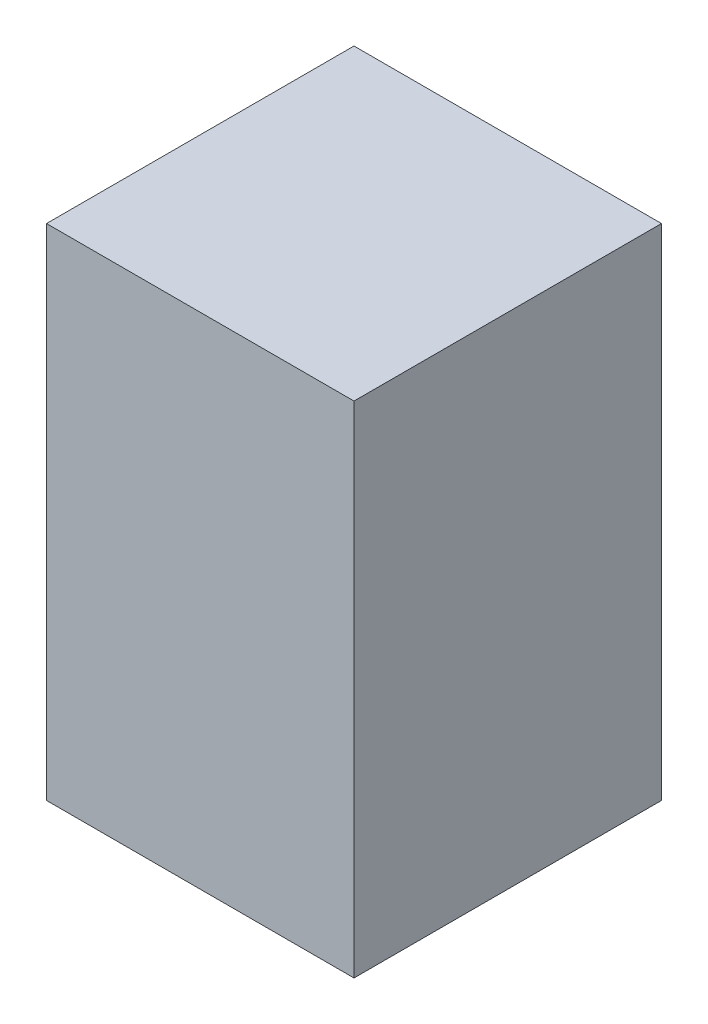
ISO-10303-21;
HEADER;
FILE_DESCRIPTION(('STEP AP214'),'2;1');
FILE_NAME('part.step','',(''),(''),'','','');
FILE_SCHEMA(('AUTOMOTIVE_DESIGN { 1 0 10303 214 1 1 1 1 }'));
ENDSEC;
DATA;
#1=APPLICATION_CONTEXT('core data for automotive mechanical design processes');
#2=APPLICATION_PROTOCOL_DEFINITION('international standard','automotive_design',2000,#1);
#3=PRODUCT_CONTEXT('',#1,'mechanical');
#4=PRODUCT('Part','Part','',(#3));
#5=PRODUCT_RELATED_PRODUCT_CATEGORY('part','',(#4));
#6=PRODUCT_DEFINITION_FORMATION('','',#4);
#7=PRODUCT_DEFINITION_CONTEXT('part definition',#1,'design');
#8=PRODUCT_DEFINITION('design','',#6,#7);
#9=PRODUCT_DEFINITION_SHAPE('','',#8);
#10=(LENGTH_UNIT() NAMED_UNIT(*) SI_UNIT(.MILLI.,.METRE.));
#11=(NAMED_UNIT(*) PLANE_ANGLE_UNIT() SI_UNIT($,.RADIAN.));
#12=(NAMED_UNIT(*) SI_UNIT($,.STERADIAN.) SOLID_ANGLE_UNIT());
#13=UNCERTAINTY_MEASURE_WITH_UNIT(LENGTH_MEASURE(1.E-05),#10,'distance_accuracy_value','');
#14=(GEOMETRIC_REPRESENTATION_CONTEXT(3) GLOBAL_UNCERTAINTY_ASSIGNED_CONTEXT((#13)) GLOBAL_UNIT_ASSIGNED_CONTEXT((#10,
#11,#12)) REPRESENTATION_CONTEXT('',''));
#15=CARTESIAN_POINT('',(0.,0.,0.));
#16=DIRECTION('',(0.,0.,1.));
#17=DIRECTION('',(1.,0.,0.));
#18=AXIS2_PLACEMENT_3D('',#15,#16,#17);
#19=CARTESIAN_POINT('',(10.,32.5,10.));
#20=DIRECTION('',(-1.,0.,0.));
#21=DIRECTION('',(0.,0.,1.));
#22=AXIS2_PLACEMENT_3D('',#19,#20,#21);
#23=PLANE('',#22);
#24=DIRECTION('',(0.,0.,-1.));
#25=VECTOR('',#24,1.);
#26=CARTESIAN_POINT('',(10.,0.,10.));
#27=LINE('',#26,#25);
#28=CARTESIAN_POINT('',(10.,0.,10.));
#29=VERTEX_POINT('',#28);
#30=CARTESIAN_POINT('',(10.,0.,-10.));
#31=VERTEX_POINT('',#30);
#32=EDGE_CURVE('E95',#29,#31,#27,.T.);
#33=ORIENTED_EDGE('',*,*,#32,.T.);
#34=DIRECTION('',(0.,-1.,0.));
#35=VECTOR('',#34,1.);
#36=CARTESIAN_POINT('',(10.,32.5,-10.));
#37=LINE('',#36,#35);
#38=CARTESIAN_POINT('',(10.,32.5,-10.));
#39=VERTEX_POINT('',#38);
#40=EDGE_CURVE('E11',#39,#31,#37,.T.);
#41=ORIENTED_EDGE('',*,*,#40,.F.);
#42=DIRECTION('',(0.,0.,-1.));
#43=VECTOR('',#42,1.);
#44=CARTESIAN_POINT('',(10.,32.5,10.));
#45=LINE('',#44,#43);
#46=CARTESIAN_POINT('',(10.,32.5,10.));
#47=VERTEX_POINT('',#46);
#48=EDGE_CURVE('E83',#47,#39,#45,.T.);
#49=ORIENTED_EDGE('',*,*,#48,.F.);
#50=DIRECTION('',(0.,-1.,0.));
#51=VECTOR('',#50,1.);
#52=CARTESIAN_POINT('',(10.,32.5,10.));
#53=LINE('',#52,#51);
#54=EDGE_CURVE('E91',#47,#29,#53,.T.);
#55=ORIENTED_EDGE('',*,*,#54,.T.);
#56=EDGE_LOOP('',(#33,#41,#49,#55));
#57=FACE_BOUND('',#56,.T.);
#58=ADVANCED_FACE('F32',(#57),#23,.F.);
#59=CARTESIAN_POINT('',(-10.,32.5,-10.));
#60=DIRECTION('',(0.,0.,1.));
#61=DIRECTION('',(1.,0.,0.));
#62=AXIS2_PLACEMENT_3D('',#59,#60,#61);
#63=PLANE('',#62);
#64=DIRECTION('',(-1.,0.,0.));
#65=VECTOR('',#64,1.);
#66=CARTESIAN_POINT('',(-10.,0.,-10.));
#67=LINE('',#66,#65);
#68=CARTESIAN_POINT('',(-10.,0.,-10.));
#69=VERTEX_POINT('',#68);
#70=EDGE_CURVE('E87',#31,#69,#67,.T.);
#71=ORIENTED_EDGE('',*,*,#70,.T.);
#72=DIRECTION('',(0.,-1.,0.));
#73=VECTOR('',#72,1.);
#74=CARTESIAN_POINT('',(-10.,32.5,-10.));
#75=LINE('',#74,#73);
#76=CARTESIAN_POINT('',(-10.,32.5,-10.));
#77=VERTEX_POINT('',#76);
#78=EDGE_CURVE('E40',#77,#69,#75,.T.);
#79=ORIENTED_EDGE('',*,*,#78,.F.);
#80=DIRECTION('',(-1.,0.,0.));
#81=VECTOR('',#80,1.);
#82=CARTESIAN_POINT('',(-10.,32.5,-10.));
#83=LINE('',#82,#81);
#84=EDGE_CURVE('E78',#39,#77,#83,.T.);
#85=ORIENTED_EDGE('',*,*,#84,.F.);
#86=ORIENTED_EDGE('',*,*,#40,.T.);
#87=EDGE_LOOP('',(#71,#79,#85,#86));
#88=FACE_BOUND('',#87,.T.);
#89=ADVANCED_FACE('F86',(#88),#63,.F.);
#90=CARTESIAN_POINT('',(-10.,32.5,10.));
#91=DIRECTION('',(1.,0.,0.));
#92=DIRECTION('',(0.,0.,-1.));
#93=AXIS2_PLACEMENT_3D('',#90,#91,#92);
#94=PLANE('',#93);
#95=DIRECTION('',(0.,0.,1.));
#96=VECTOR('',#95,1.);
#97=CARTESIAN_POINT('',(-10.,0.,10.));
#98=LINE('',#97,#96);
#99=CARTESIAN_POINT('',(-10.,0.,10.));
#100=VERTEX_POINT('',#99);
#101=EDGE_CURVE('E65',#69,#100,#98,.T.);
#102=ORIENTED_EDGE('',*,*,#101,.T.);
#103=DIRECTION('',(0.,-1.,0.));
#104=VECTOR('',#103,1.);
#105=CARTESIAN_POINT('',(-10.,32.5,10.));
#106=LINE('',#105,#104);
#107=CARTESIAN_POINT('',(-10.,32.5,10.));
#108=VERTEX_POINT('',#107);
#109=EDGE_CURVE('E88',#108,#100,#106,.T.);
#110=ORIENTED_EDGE('',*,*,#109,.F.);
#111=DIRECTION('',(0.,0.,1.));
#112=VECTOR('',#111,1.);
#113=CARTESIAN_POINT('',(-10.,32.5,10.));
#114=LINE('',#113,#112);
#115=EDGE_CURVE('E81',#77,#108,#114,.T.);
#116=ORIENTED_EDGE('',*,*,#115,.F.);
#117=ORIENTED_EDGE('',*,*,#78,.T.);
#118=EDGE_LOOP('',(#102,#110,#116,#117));
#119=FACE_BOUND('',#118,.T.);
#120=ADVANCED_FACE('F89',(#119),#94,.F.);
#121=CARTESIAN_POINT('',(-10.,32.5,10.));
#122=DIRECTION('',(0.,0.,-1.));
#123=DIRECTION('',(-1.,0.,0.));
#124=AXIS2_PLACEMENT_3D('',#121,#122,#123);
#125=PLANE('',#124);
#126=DIRECTION('',(1.,0.,0.));
#127=VECTOR('',#126,1.);
#128=CARTESIAN_POINT('',(-10.,0.,10.));
#129=LINE('',#128,#127);
#130=EDGE_CURVE('E71',#100,#29,#129,.T.);
#131=ORIENTED_EDGE('',*,*,#130,.T.);
#132=ORIENTED_EDGE('',*,*,#54,.F.);
#133=DIRECTION('',(1.,0.,0.));
#134=VECTOR('',#133,1.);
#135=CARTESIAN_POINT('',(-10.,32.5,10.));
#136=LINE('',#135,#134);
#137=EDGE_CURVE('E48',#108,#47,#136,.T.);
#138=ORIENTED_EDGE('',*,*,#137,.F.);
#139=ORIENTED_EDGE('',*,*,#109,.T.);
#140=EDGE_LOOP('',(#131,#132,#138,#139));
#141=FACE_BOUND('',#140,.T.);
#142=ADVANCED_FACE('F102',(#141),#125,.F.);
#143=CARTESIAN_POINT('',(0.,32.5,0.));
#144=DIRECTION('',(0.,-1.,0.));
#145=DIRECTION('',(0.,0.,-1.));
#146=AXIS2_PLACEMENT_3D('',#143,#144,#145);
#147=PLANE('',#146);
#148=ORIENTED_EDGE('',*,*,#48,.T.);
#149=ORIENTED_EDGE('',*,*,#84,.T.);
#150=ORIENTED_EDGE('',*,*,#115,.T.);
#151=ORIENTED_EDGE('',*,*,#137,.T.);
#152=EDGE_LOOP('',(#148,#149,#150,#151));
#153=FACE_BOUND('',#152,.T.);
#154=ADVANCED_FACE('F79',(#153),#147,.F.);
#155=CARTESIAN_POINT('',(0.,0.,0.));
#156=DIRECTION('',(0.,-1.,0.));
#157=DIRECTION('',(0.,0.,-1.));
#158=AXIS2_PLACEMENT_3D('',#155,#156,#157);
#159=PLANE('',#158);
#160=ORIENTED_EDGE('',*,*,#32,.F.);
#161=ORIENTED_EDGE('',*,*,#130,.F.);
#162=ORIENTED_EDGE('',*,*,#101,.F.);
#163=ORIENTED_EDGE('',*,*,#70,.F.);
#164=EDGE_LOOP('',(#160,#161,#162,#163));
#165=FACE_BOUND('',#164,.T.);
#166=ADVANCED_FACE('F105',(#165),#159,.T.);
#167=CLOSED_SHELL('',(#58,#89,#120,#142,#154,#166));
#168=MANIFOLD_SOLID_BREP('B2',#167);
#169=ADVANCED_BREP_SHAPE_REPRESENTATION('',(#18,#168),#14);
#170=SHAPE_DEFINITION_REPRESENTATION(#9,#169);
ENDSEC;
END-ISO-10303-21;
